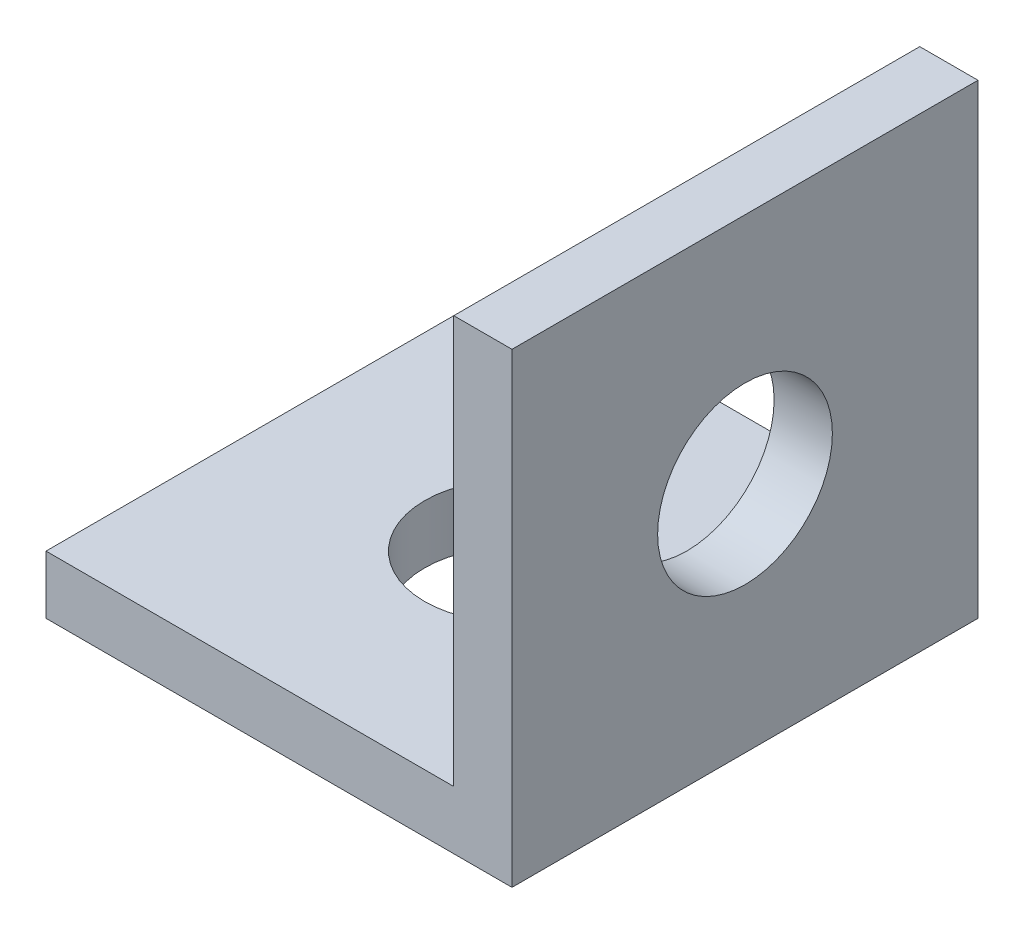
ISO-10303-21;
HEADER;
FILE_DESCRIPTION(('STEP AP214'),'2;1');
FILE_NAME('part.step','',(''),(''),'','','');
FILE_SCHEMA(('AUTOMOTIVE_DESIGN { 1 0 10303 214 1 1 1 1 }'));
ENDSEC;
DATA;
#1=APPLICATION_CONTEXT('core data for automotive mechanical design processes');
#2=APPLICATION_PROTOCOL_DEFINITION('international standard','automotive_design',2000,#1);
#3=PRODUCT_CONTEXT('',#1,'mechanical');
#4=PRODUCT('Part','Part','',(#3));
#5=PRODUCT_RELATED_PRODUCT_CATEGORY('part','',(#4));
#6=PRODUCT_DEFINITION_FORMATION('','',#4);
#7=PRODUCT_DEFINITION_CONTEXT('part definition',#1,'design');
#8=PRODUCT_DEFINITION('design','',#6,#7);
#9=PRODUCT_DEFINITION_SHAPE('','',#8);
#10=(LENGTH_UNIT() NAMED_UNIT(*) SI_UNIT(.MILLI.,.METRE.));
#11=(NAMED_UNIT(*) PLANE_ANGLE_UNIT() SI_UNIT($,.RADIAN.));
#12=(NAMED_UNIT(*) SI_UNIT($,.STERADIAN.) SOLID_ANGLE_UNIT());
#13=UNCERTAINTY_MEASURE_WITH_UNIT(LENGTH_MEASURE(1.E-05),#10,'distance_accuracy_value','');
#14=(GEOMETRIC_REPRESENTATION_CONTEXT(3) GLOBAL_UNCERTAINTY_ASSIGNED_CONTEXT((#13)) GLOBAL_UNIT_ASSIGNED_CONTEXT((#10,
#11,#12)) REPRESENTATION_CONTEXT('',''));
#15=CARTESIAN_POINT('',(0.,0.,0.));
#16=DIRECTION('',(0.,0.,1.));
#17=DIRECTION('',(1.,0.,0.));
#18=AXIS2_PLACEMENT_3D('',#15,#16,#17);
#19=CARTESIAN_POINT('',(0.,1.,-8.));
#20=DIRECTION('',(0.,-1.,0.));
#21=DIRECTION('',(0.,0.,-1.));
#22=AXIS2_PLACEMENT_3D('',#19,#20,#21);
#23=PLANE('',#22);
#24=CARTESIAN_POINT('',(4.,1.,-4.));
#25=DIRECTION('',(0.,1.,0.));
#26=DIRECTION('',(0.,0.,1.));
#27=AXIS2_PLACEMENT_3D('',#24,#25,#26);
#28=CIRCLE('',#27,1.5);
#29=CARTESIAN_POINT('',(4.,1.,-2.5));
#30=VERTEX_POINT('',#29);
#31=EDGE_CURVE('E94',#30,#30,#28,.T.);
#32=ORIENTED_EDGE('',*,*,#31,.F.);
#33=EDGE_LOOP('',(#32));
#34=FACE_BOUND('',#33,.T.);
#35=DIRECTION('',(0.,0.,1.));
#36=VECTOR('',#35,1.);
#37=CARTESIAN_POINT('',(7.,1.,0.));
#38=LINE('',#37,#36);
#39=CARTESIAN_POINT('',(7.,1.,-8.));
#40=VERTEX_POINT('',#39);
#41=CARTESIAN_POINT('',(7.,1.,0.));
#42=VERTEX_POINT('',#41);
#43=EDGE_CURVE('E47',#40,#42,#38,.T.);
#44=ORIENTED_EDGE('',*,*,#43,.F.);
#45=DIRECTION('',(-1.,0.,0.));
#46=VECTOR('',#45,1.);
#47=CARTESIAN_POINT('',(0.,1.,-8.));
#48=LINE('',#47,#46);
#49=CARTESIAN_POINT('',(0.,1.,-8.));
#50=VERTEX_POINT('',#49);
#51=EDGE_CURVE('E52',#40,#50,#48,.T.);
#52=ORIENTED_EDGE('',*,*,#51,.T.);
#53=DIRECTION('',(0.,0.,1.));
#54=VECTOR('',#53,1.);
#55=CARTESIAN_POINT('',(0.,1.,0.));
#56=LINE('',#55,#54);
#57=CARTESIAN_POINT('',(0.,1.,0.));
#58=VERTEX_POINT('',#57);
#59=EDGE_CURVE('E83',#50,#58,#56,.T.);
#60=ORIENTED_EDGE('',*,*,#59,.T.);
#61=DIRECTION('',(1.,0.,0.));
#62=VECTOR('',#61,1.);
#63=CARTESIAN_POINT('',(0.,1.,0.));
#64=LINE('',#63,#62);
#65=EDGE_CURVE('E108',#58,#42,#64,.T.);
#66=ORIENTED_EDGE('',*,*,#65,.T.);
#67=EDGE_LOOP('',(#44,#52,#60,#66));
#68=FACE_BOUND('',#67,.T.);
#69=ADVANCED_FACE('F30',(#34,#68),#23,.F.);
#70=CARTESIAN_POINT('',(0.,0.,-8.));
#71=DIRECTION('',(0.,-1.,0.));
#72=DIRECTION('',(0.,0.,-1.));
#73=AXIS2_PLACEMENT_3D('',#70,#71,#72);
#74=PLANE('',#73);
#75=DIRECTION('',(0.,0.,1.));
#76=VECTOR('',#75,1.);
#77=CARTESIAN_POINT('',(0.,0.,0.));
#78=LINE('',#77,#76);
#79=CARTESIAN_POINT('',(0.,0.,-8.));
#80=VERTEX_POINT('',#79);
#81=CARTESIAN_POINT('',(0.,0.,0.));
#82=VERTEX_POINT('',#81);
#83=EDGE_CURVE('E89',#80,#82,#78,.T.);
#84=ORIENTED_EDGE('',*,*,#83,.F.);
#85=DIRECTION('',(-1.,0.,0.));
#86=VECTOR('',#85,1.);
#87=CARTESIAN_POINT('',(0.,0.,-8.));
#88=LINE('',#87,#86);
#89=CARTESIAN_POINT('',(8.,0.,-8.));
#90=VERTEX_POINT('',#89);
#91=EDGE_CURVE('E72',#90,#80,#88,.T.);
#92=ORIENTED_EDGE('',*,*,#91,.F.);
#93=DIRECTION('',(0.,0.,-1.));
#94=VECTOR('',#93,1.);
#95=CARTESIAN_POINT('',(8.,0.,0.));
#96=LINE('',#95,#94);
#97=CARTESIAN_POINT('',(8.,0.,0.));
#98=VERTEX_POINT('',#97);
#99=EDGE_CURVE('E84',#98,#90,#96,.T.);
#100=ORIENTED_EDGE('',*,*,#99,.F.);
#101=DIRECTION('',(1.,0.,0.));
#102=VECTOR('',#101,1.);
#103=CARTESIAN_POINT('',(0.,0.,0.));
#104=LINE('',#103,#102);
#105=EDGE_CURVE('E93',#82,#98,#104,.T.);
#106=ORIENTED_EDGE('',*,*,#105,.F.);
#107=EDGE_LOOP('',(#84,#92,#100,#106));
#108=FACE_BOUND('',#107,.T.);
#109=CARTESIAN_POINT('',(4.,0.,-4.));
#110=DIRECTION('',(0.,1.,0.));
#111=DIRECTION('',(0.,0.,1.));
#112=AXIS2_PLACEMENT_3D('',#109,#110,#111);
#113=CIRCLE('',#112,1.5);
#114=CARTESIAN_POINT('',(4.,0.,-2.5));
#115=VERTEX_POINT('',#114);
#116=EDGE_CURVE('E98',#115,#115,#113,.T.);
#117=ORIENTED_EDGE('',*,*,#116,.T.);
#118=EDGE_LOOP('',(#117));
#119=FACE_BOUND('',#118,.T.);
#120=ADVANCED_FACE('F91',(#108,#119),#74,.T.);
#121=CARTESIAN_POINT('',(0.,1.,0.));
#122=DIRECTION('',(1.,0.,0.));
#123=DIRECTION('',(0.,0.,-1.));
#124=AXIS2_PLACEMENT_3D('',#121,#122,#123);
#125=PLANE('',#124);
#126=ORIENTED_EDGE('',*,*,#83,.T.);
#127=DIRECTION('',(0.,-1.,0.));
#128=VECTOR('',#127,1.);
#129=CARTESIAN_POINT('',(0.,1.,0.));
#130=LINE('',#129,#128);
#131=EDGE_CURVE('E11',#58,#82,#130,.T.);
#132=ORIENTED_EDGE('',*,*,#131,.F.);
#133=ORIENTED_EDGE('',*,*,#59,.F.);
#134=DIRECTION('',(0.,-1.,0.));
#135=VECTOR('',#134,1.);
#136=CARTESIAN_POINT('',(0.,1.,-8.));
#137=LINE('',#136,#135);
#138=EDGE_CURVE('E75',#50,#80,#137,.T.);
#139=ORIENTED_EDGE('',*,*,#138,.T.);
#140=EDGE_LOOP('',(#126,#132,#133,#139));
#141=FACE_BOUND('',#140,.T.);
#142=ADVANCED_FACE('F32',(#141),#125,.F.);
#143=CARTESIAN_POINT('',(0.,1.,0.));
#144=DIRECTION('',(0.,0.,-1.));
#145=DIRECTION('',(-1.,0.,0.));
#146=AXIS2_PLACEMENT_3D('',#143,#144,#145);
#147=PLANE('',#146);
#148=ORIENTED_EDGE('',*,*,#105,.T.);
#149=DIRECTION('',(0.,-1.,0.));
#150=VECTOR('',#149,1.);
#151=CARTESIAN_POINT('',(8.,1.,0.));
#152=LINE('',#151,#150);
#153=CARTESIAN_POINT('',(8.,8.,0.));
#154=VERTEX_POINT('',#153);
#155=EDGE_CURVE('E39',#154,#98,#152,.T.);
#156=ORIENTED_EDGE('',*,*,#155,.F.);
#157=DIRECTION('',(1.,0.,0.));
#158=VECTOR('',#157,1.);
#159=CARTESIAN_POINT('',(8.,8.,0.));
#160=LINE('',#159,#158);
#161=CARTESIAN_POINT('',(7.,8.,0.));
#162=VERTEX_POINT('',#161);
#163=EDGE_CURVE('E119',#162,#154,#160,.T.);
#164=ORIENTED_EDGE('',*,*,#163,.F.);
#165=DIRECTION('',(0.,-1.,0.));
#166=VECTOR('',#165,1.);
#167=CARTESIAN_POINT('',(7.,8.,0.));
#168=LINE('',#167,#166);
#169=EDGE_CURVE('E124',#162,#42,#168,.T.);
#170=ORIENTED_EDGE('',*,*,#169,.T.);
#171=ORIENTED_EDGE('',*,*,#65,.F.);
#172=ORIENTED_EDGE('',*,*,#131,.T.);
#173=EDGE_LOOP('',(#148,#156,#164,#170,#171,#172));
#174=FACE_BOUND('',#173,.T.);
#175=ADVANCED_FACE('F150',(#174),#147,.F.);
#176=CARTESIAN_POINT('',(8.,1.,0.));
#177=DIRECTION('',(-1.,0.,0.));
#178=DIRECTION('',(0.,0.,1.));
#179=AXIS2_PLACEMENT_3D('',#176,#177,#178);
#180=PLANE('',#179);
#181=CARTESIAN_POINT('',(8.,4.,-4.));
#182=DIRECTION('',(1.,0.,0.));
#183=DIRECTION('',(0.,0.,-1.));
#184=AXIS2_PLACEMENT_3D('',#181,#182,#183);
#185=CIRCLE('',#184,1.5);
#186=CARTESIAN_POINT('',(8.,4.,-5.5));
#187=VERTEX_POINT('',#186);
#188=EDGE_CURVE('E159',#187,#187,#185,.T.);
#189=ORIENTED_EDGE('',*,*,#188,.F.);
#190=EDGE_LOOP('',(#189));
#191=FACE_BOUND('',#190,.T.);
#192=ORIENTED_EDGE('',*,*,#99,.T.);
#193=DIRECTION('',(0.,-1.,0.));
#194=VECTOR('',#193,1.);
#195=CARTESIAN_POINT('',(8.,1.,-8.));
#196=LINE('',#195,#194);
#197=CARTESIAN_POINT('',(8.,8.,-8.));
#198=VERTEX_POINT('',#197);
#199=EDGE_CURVE('E79',#198,#90,#196,.T.);
#200=ORIENTED_EDGE('',*,*,#199,.F.);
#201=DIRECTION('',(0.,0.,-1.));
#202=VECTOR('',#201,1.);
#203=CARTESIAN_POINT('',(8.,8.,0.));
#204=LINE('',#203,#202);
#205=EDGE_CURVE('E122',#154,#198,#204,.T.);
#206=ORIENTED_EDGE('',*,*,#205,.F.);
#207=ORIENTED_EDGE('',*,*,#155,.T.);
#208=EDGE_LOOP('',(#192,#200,#206,#207));
#209=FACE_BOUND('',#208,.T.);
#210=ADVANCED_FACE('F166',(#191,#209),#180,.F.);
#211=CARTESIAN_POINT('',(0.,1.,-8.));
#212=DIRECTION('',(0.,0.,1.));
#213=DIRECTION('',(1.,0.,0.));
#214=AXIS2_PLACEMENT_3D('',#211,#212,#213);
#215=PLANE('',#214);
#216=ORIENTED_EDGE('',*,*,#91,.T.);
#217=ORIENTED_EDGE('',*,*,#138,.F.);
#218=ORIENTED_EDGE('',*,*,#51,.F.);
#219=DIRECTION('',(0.,-1.,0.));
#220=VECTOR('',#219,1.);
#221=CARTESIAN_POINT('',(7.,8.,-8.));
#222=LINE('',#221,#220);
#223=CARTESIAN_POINT('',(7.,8.,-8.));
#224=VERTEX_POINT('',#223);
#225=EDGE_CURVE('E115',#224,#40,#222,.T.);
#226=ORIENTED_EDGE('',*,*,#225,.F.);
#227=DIRECTION('',(-1.,0.,0.));
#228=VECTOR('',#227,1.);
#229=CARTESIAN_POINT('',(8.,8.,-8.));
#230=LINE('',#229,#228);
#231=EDGE_CURVE('E140',#198,#224,#230,.T.);
#232=ORIENTED_EDGE('',*,*,#231,.F.);
#233=ORIENTED_EDGE('',*,*,#199,.T.);
#234=EDGE_LOOP('',(#216,#217,#218,#226,#232,#233));
#235=FACE_BOUND('',#234,.T.);
#236=ADVANCED_FACE('F74',(#235),#215,.F.);
#237=CARTESIAN_POINT('',(4.,1.,-4.));
#238=DIRECTION('',(0.,-1.,0.));
#239=DIRECTION('',(0.,0.,-1.));
#240=AXIS2_PLACEMENT_3D('',#237,#238,#239);
#241=CYLINDRICAL_SURFACE('',#240,1.5);
#242=ORIENTED_EDGE('',*,*,#31,.T.);
#243=EDGE_LOOP('',(#242));
#244=FACE_BOUND('',#243,.T.);
#245=ORIENTED_EDGE('',*,*,#116,.F.);
#246=EDGE_LOOP('',(#245));
#247=FACE_BOUND('',#246,.T.);
#248=ADVANCED_FACE('F178',(#244,#247),#241,.F.);
#249=CARTESIAN_POINT('',(7.,8.,0.));
#250=DIRECTION('',(1.,0.,0.));
#251=DIRECTION('',(0.,0.,-1.));
#252=AXIS2_PLACEMENT_3D('',#249,#250,#251);
#253=PLANE('',#252);
#254=CARTESIAN_POINT('',(7.,4.,-4.));
#255=DIRECTION('',(1.,0.,0.));
#256=DIRECTION('',(0.,0.,-1.));
#257=AXIS2_PLACEMENT_3D('',#254,#255,#256);
#258=CIRCLE('',#257,1.5);
#259=CARTESIAN_POINT('',(7.,4.,-5.5));
#260=VERTEX_POINT('',#259);
#261=EDGE_CURVE('E123',#260,#260,#258,.F.);
#262=ORIENTED_EDGE('',*,*,#261,.F.);
#263=EDGE_LOOP('',(#262));
#264=FACE_BOUND('',#263,.T.);
#265=ORIENTED_EDGE('',*,*,#43,.T.);
#266=ORIENTED_EDGE('',*,*,#169,.F.);
#267=DIRECTION('',(0.,0.,1.));
#268=VECTOR('',#267,1.);
#269=CARTESIAN_POINT('',(7.,8.,0.));
#270=LINE('',#269,#268);
#271=EDGE_CURVE('E137',#224,#162,#270,.T.);
#272=ORIENTED_EDGE('',*,*,#271,.F.);
#273=ORIENTED_EDGE('',*,*,#225,.T.);
#274=EDGE_LOOP('',(#265,#266,#272,#273));
#275=FACE_BOUND('',#274,.T.);
#276=ADVANCED_FACE('F132',(#264,#275),#253,.F.);
#277=CARTESIAN_POINT('',(8.,8.,-8.));
#278=DIRECTION('',(0.,1.,0.));
#279=DIRECTION('',(0.,0.,1.));
#280=AXIS2_PLACEMENT_3D('',#277,#278,#279);
#281=PLANE('',#280);
#282=ORIENTED_EDGE('',*,*,#205,.T.);
#283=ORIENTED_EDGE('',*,*,#231,.T.);
#284=ORIENTED_EDGE('',*,*,#271,.T.);
#285=ORIENTED_EDGE('',*,*,#163,.T.);
#286=EDGE_LOOP('',(#282,#283,#284,#285));
#287=FACE_BOUND('',#286,.T.);
#288=ADVANCED_FACE('F170',(#287),#281,.T.);
#289=CARTESIAN_POINT('',(-0.00102499999999998,4.,-4.));
#290=DIRECTION('',(1.,0.,0.));
#291=DIRECTION('',(0.,0.,-1.));
#292=AXIS2_PLACEMENT_3D('',#289,#290,#291);
#293=CYLINDRICAL_SURFACE('',#292,1.5);
#294=ORIENTED_EDGE('',*,*,#188,.T.);
#295=EDGE_LOOP('',(#294));
#296=FACE_BOUND('',#295,.T.);
#297=ORIENTED_EDGE('',*,*,#261,.T.);
#298=EDGE_LOOP('',(#297));
#299=FACE_BOUND('',#298,.T.);
#300=ADVANCED_FACE('F163',(#296,#299),#293,.F.);
#301=CLOSED_SHELL('',(#69,#120,#142,#175,#210,#236,#248,#276,#288,#300));
#302=MANIFOLD_SOLID_BREP('B2',#301);
#303=ADVANCED_BREP_SHAPE_REPRESENTATION('',(#18,#302),#14);
#304=SHAPE_DEFINITION_REPRESENTATION(#9,#303);
ENDSEC;
END-ISO-10303-21;
